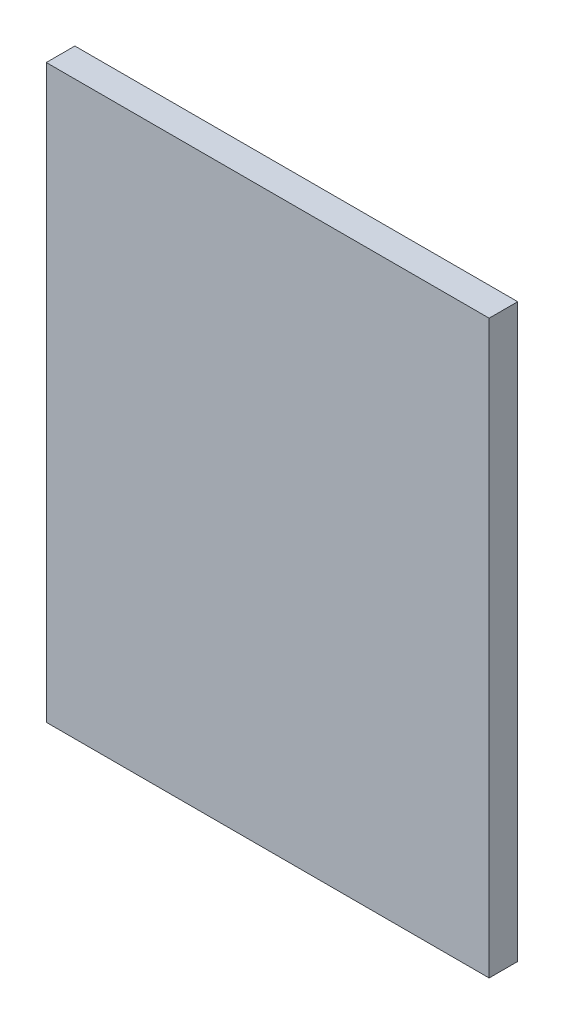
ISO-10303-21;
HEADER;
FILE_DESCRIPTION(('STEP AP214'),'2;1');
FILE_NAME('part.step','',(''),(''),'','','');
FILE_SCHEMA(('AUTOMOTIVE_DESIGN { 1 0 10303 214 1 1 1 1 }'));
ENDSEC;
DATA;
#1=APPLICATION_CONTEXT('core data for automotive mechanical design processes');
#2=APPLICATION_PROTOCOL_DEFINITION('international standard','automotive_design',2000,#1);
#3=PRODUCT_CONTEXT('',#1,'mechanical');
#4=PRODUCT('Part','Part','',(#3));
#5=PRODUCT_RELATED_PRODUCT_CATEGORY('part','',(#4));
#6=PRODUCT_DEFINITION_FORMATION('','',#4);
#7=PRODUCT_DEFINITION_CONTEXT('part definition',#1,'design');
#8=PRODUCT_DEFINITION('design','',#6,#7);
#9=PRODUCT_DEFINITION_SHAPE('','',#8);
#10=(LENGTH_UNIT() NAMED_UNIT(*) SI_UNIT(.MILLI.,.METRE.));
#11=(NAMED_UNIT(*) PLANE_ANGLE_UNIT() SI_UNIT($,.RADIAN.));
#12=(NAMED_UNIT(*) SI_UNIT($,.STERADIAN.) SOLID_ANGLE_UNIT());
#13=UNCERTAINTY_MEASURE_WITH_UNIT(LENGTH_MEASURE(1.E-05),#10,'distance_accuracy_value','');
#14=(GEOMETRIC_REPRESENTATION_CONTEXT(3) GLOBAL_UNCERTAINTY_ASSIGNED_CONTEXT((#13)) GLOBAL_UNIT_ASSIGNED_CONTEXT((#10,
#11,#12)) REPRESENTATION_CONTEXT('',''));
#15=CARTESIAN_POINT('',(0.,0.,0.));
#16=DIRECTION('',(0.,0.,1.));
#17=DIRECTION('',(1.,0.,0.));
#18=AXIS2_PLACEMENT_3D('',#15,#16,#17);
#19=CARTESIAN_POINT('',(0.,0.,10.));
#20=DIRECTION('',(1.,0.,0.));
#21=DIRECTION('',(0.,0.,-1.));
#22=AXIS2_PLACEMENT_3D('',#19,#20,#21);
#23=PLANE('',#22);
#24=DIRECTION('',(0.,-1.,0.));
#25=VECTOR('',#24,1.);
#26=CARTESIAN_POINT('',(0.,0.,0.));
#27=LINE('',#26,#25);
#28=CARTESIAN_POINT('',(0.,200.,0.));
#29=VERTEX_POINT('',#28);
#30=CARTESIAN_POINT('',(0.,0.,0.));
#31=VERTEX_POINT('',#30);
#32=EDGE_CURVE('E107',#29,#31,#27,.T.);
#33=ORIENTED_EDGE('',*,*,#32,.T.);
#34=DIRECTION('',(0.,0.,-1.));
#35=VECTOR('',#34,1.);
#36=CARTESIAN_POINT('',(0.,0.,10.));
#37=LINE('',#36,#35);
#38=CARTESIAN_POINT('',(0.,0.,10.));
#39=VERTEX_POINT('',#38);
#40=EDGE_CURVE('E11',#39,#31,#37,.T.);
#41=ORIENTED_EDGE('',*,*,#40,.F.);
#42=DIRECTION('',(0.,-1.,0.));
#43=VECTOR('',#42,1.);
#44=CARTESIAN_POINT('',(0.,0.,10.));
#45=LINE('',#44,#43);
#46=CARTESIAN_POINT('',(0.,200.,10.));
#47=VERTEX_POINT('',#46);
#48=EDGE_CURVE('E91',#47,#39,#45,.T.);
#49=ORIENTED_EDGE('',*,*,#48,.F.);
#50=DIRECTION('',(0.,0.,-1.));
#51=VECTOR('',#50,1.);
#52=CARTESIAN_POINT('',(0.,200.,10.));
#53=LINE('',#52,#51);
#54=EDGE_CURVE('E103',#47,#29,#53,.T.);
#55=ORIENTED_EDGE('',*,*,#54,.T.);
#56=EDGE_LOOP('',(#33,#41,#49,#55));
#57=FACE_BOUND('',#56,.T.);
#58=ADVANCED_FACE('F39',(#57),#23,.F.);
#59=CARTESIAN_POINT('',(0.,0.,10.));
#60=DIRECTION('',(0.,1.,0.));
#61=DIRECTION('',(0.,0.,1.));
#62=AXIS2_PLACEMENT_3D('',#59,#60,#61);
#63=PLANE('',#62);
#64=DIRECTION('',(1.,0.,0.));
#65=VECTOR('',#64,1.);
#66=CARTESIAN_POINT('',(0.,0.,0.));
#67=LINE('',#66,#65);
#68=CARTESIAN_POINT('',(155.,0.,0.));
#69=VERTEX_POINT('',#68);
#70=EDGE_CURVE('E96',#31,#69,#67,.T.);
#71=ORIENTED_EDGE('',*,*,#70,.T.);
#72=DIRECTION('',(0.,0.,-1.));
#73=VECTOR('',#72,1.);
#74=CARTESIAN_POINT('',(155.,0.,10.));
#75=LINE('',#74,#73);
#76=CARTESIAN_POINT('',(155.,0.,10.));
#77=VERTEX_POINT('',#76);
#78=EDGE_CURVE('E48',#77,#69,#75,.T.);
#79=ORIENTED_EDGE('',*,*,#78,.F.);
#80=DIRECTION('',(1.,0.,0.));
#81=VECTOR('',#80,1.);
#82=CARTESIAN_POINT('',(0.,0.,10.));
#83=LINE('',#82,#81);
#84=EDGE_CURVE('E86',#39,#77,#83,.T.);
#85=ORIENTED_EDGE('',*,*,#84,.F.);
#86=ORIENTED_EDGE('',*,*,#40,.T.);
#87=EDGE_LOOP('',(#71,#79,#85,#86));
#88=FACE_BOUND('',#87,.T.);
#89=ADVANCED_FACE('F95',(#88),#63,.F.);
#90=CARTESIAN_POINT('',(155.,0.,10.));
#91=DIRECTION('',(-1.,0.,0.));
#92=DIRECTION('',(0.,0.,1.));
#93=AXIS2_PLACEMENT_3D('',#90,#91,#92);
#94=PLANE('',#93);
#95=DIRECTION('',(0.,1.,0.));
#96=VECTOR('',#95,1.);
#97=CARTESIAN_POINT('',(155.,0.,0.));
#98=LINE('',#97,#96);
#99=CARTESIAN_POINT('',(155.,200.,0.));
#100=VERTEX_POINT('',#99);
#101=EDGE_CURVE('E73',#69,#100,#98,.T.);
#102=ORIENTED_EDGE('',*,*,#101,.T.);
#103=DIRECTION('',(0.,0.,-1.));
#104=VECTOR('',#103,1.);
#105=CARTESIAN_POINT('',(155.,200.,10.));
#106=LINE('',#105,#104);
#107=CARTESIAN_POINT('',(155.,200.,10.));
#108=VERTEX_POINT('',#107);
#109=EDGE_CURVE('E98',#108,#100,#106,.T.);
#110=ORIENTED_EDGE('',*,*,#109,.F.);
#111=DIRECTION('',(0.,1.,0.));
#112=VECTOR('',#111,1.);
#113=CARTESIAN_POINT('',(155.,0.,10.));
#114=LINE('',#113,#112);
#115=EDGE_CURVE('E89',#77,#108,#114,.T.);
#116=ORIENTED_EDGE('',*,*,#115,.F.);
#117=ORIENTED_EDGE('',*,*,#78,.T.);
#118=EDGE_LOOP('',(#102,#110,#116,#117));
#119=FACE_BOUND('',#118,.T.);
#120=ADVANCED_FACE('F99',(#119),#94,.F.);
#121=CARTESIAN_POINT('',(0.,200.,10.));
#122=DIRECTION('',(0.,-1.,0.));
#123=DIRECTION('',(0.,0.,-1.));
#124=AXIS2_PLACEMENT_3D('',#121,#122,#123);
#125=PLANE('',#124);
#126=DIRECTION('',(-1.,0.,0.));
#127=VECTOR('',#126,1.);
#128=CARTESIAN_POINT('',(0.,200.,0.));
#129=LINE('',#128,#127);
#130=EDGE_CURVE('E79',#100,#29,#129,.T.);
#131=ORIENTED_EDGE('',*,*,#130,.T.);
#132=ORIENTED_EDGE('',*,*,#54,.F.);
#133=DIRECTION('',(-1.,0.,0.));
#134=VECTOR('',#133,1.);
#135=CARTESIAN_POINT('',(0.,200.,10.));
#136=LINE('',#135,#134);
#137=EDGE_CURVE('E56',#108,#47,#136,.T.);
#138=ORIENTED_EDGE('',*,*,#137,.F.);
#139=ORIENTED_EDGE('',*,*,#109,.T.);
#140=EDGE_LOOP('',(#131,#132,#138,#139));
#141=FACE_BOUND('',#140,.T.);
#142=ADVANCED_FACE('F120',(#141),#125,.F.);
#143=CARTESIAN_POINT('',(0.,0.,10.));
#144=DIRECTION('',(0.,0.,-1.));
#145=DIRECTION('',(-1.,0.,0.));
#146=AXIS2_PLACEMENT_3D('',#143,#144,#145);
#147=PLANE('',#146);
#148=ORIENTED_EDGE('',*,*,#48,.T.);
#149=ORIENTED_EDGE('',*,*,#84,.T.);
#150=ORIENTED_EDGE('',*,*,#115,.T.);
#151=ORIENTED_EDGE('',*,*,#137,.T.);
#152=EDGE_LOOP('',(#148,#149,#150,#151));
#153=FACE_BOUND('',#152,.T.);
#154=ADVANCED_FACE('F87',(#153),#147,.F.);
#155=CARTESIAN_POINT('',(0.,0.,0.));
#156=DIRECTION('',(0.,0.,-1.));
#157=DIRECTION('',(-1.,0.,0.));
#158=AXIS2_PLACEMENT_3D('',#155,#156,#157);
#159=PLANE('',#158);
#160=ORIENTED_EDGE('',*,*,#32,.F.);
#161=ORIENTED_EDGE('',*,*,#130,.F.);
#162=ORIENTED_EDGE('',*,*,#101,.F.);
#163=ORIENTED_EDGE('',*,*,#70,.F.);
#164=EDGE_LOOP('',(#160,#161,#162,#163));
#165=FACE_BOUND('',#164,.T.);
#166=ADVANCED_FACE('F123',(#165),#159,.T.);
#167=CLOSED_SHELL('',(#58,#89,#120,#142,#154,#166));
#168=MANIFOLD_SOLID_BREP('B2',#167);
#169=ADVANCED_BREP_SHAPE_REPRESENTATION('',(#18,#168),#14);
#170=SHAPE_DEFINITION_REPRESENTATION(#9,#169);
ENDSEC;
END-ISO-10303-21;
